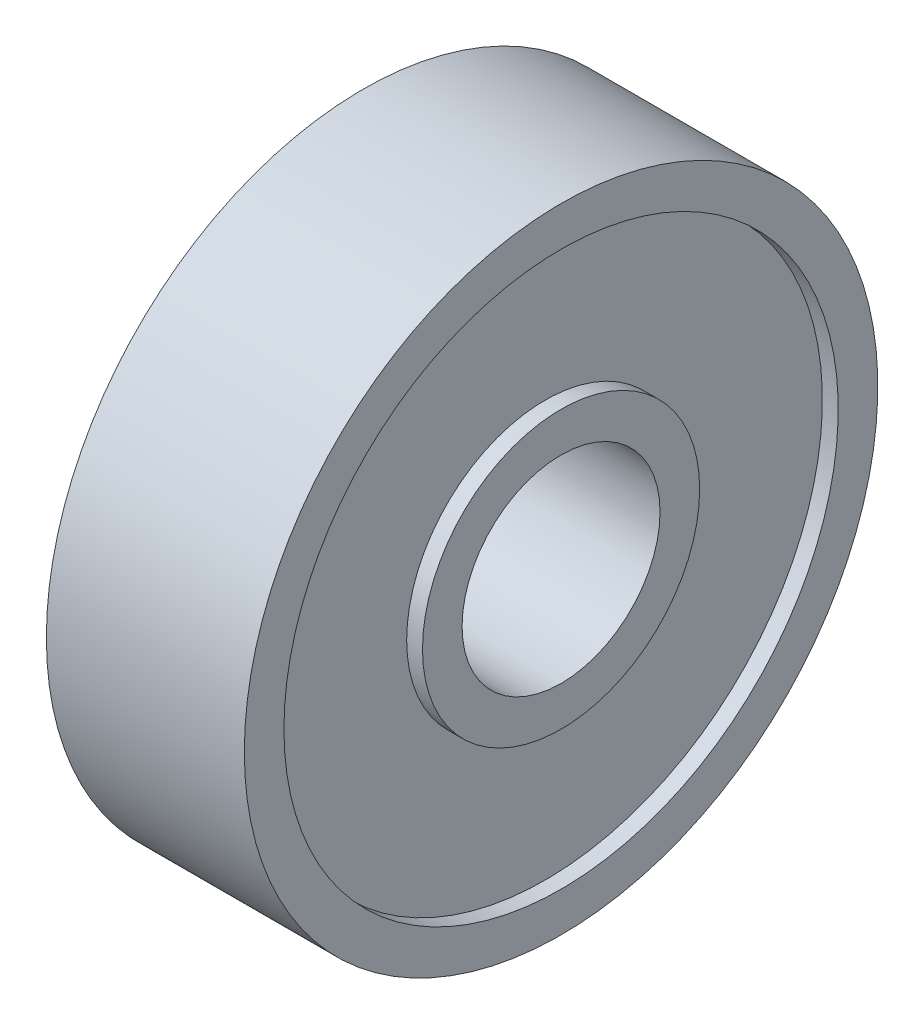
ISO-10303-21;
HEADER;
FILE_DESCRIPTION(('STEP AP214'),'2;1');
FILE_NAME('part.step','',(''),(''),'','','');
FILE_SCHEMA(('AUTOMOTIVE_DESIGN { 1 0 10303 214 1 1 1 1 }'));
ENDSEC;
DATA;
#1=APPLICATION_CONTEXT('core data for automotive mechanical design processes');
#2=APPLICATION_PROTOCOL_DEFINITION('international standard','automotive_design',2000,#1);
#3=PRODUCT_CONTEXT('',#1,'mechanical');
#4=PRODUCT('Part','Part','',(#3));
#5=PRODUCT_RELATED_PRODUCT_CATEGORY('part','',(#4));
#6=PRODUCT_DEFINITION_FORMATION('','',#4);
#7=PRODUCT_DEFINITION_CONTEXT('part definition',#1,'design');
#8=PRODUCT_DEFINITION('design','',#6,#7);
#9=PRODUCT_DEFINITION_SHAPE('','',#8);
#10=(LENGTH_UNIT() NAMED_UNIT(*) SI_UNIT(.MILLI.,.METRE.));
#11=(NAMED_UNIT(*) PLANE_ANGLE_UNIT() SI_UNIT($,.RADIAN.));
#12=(NAMED_UNIT(*) SI_UNIT($,.STERADIAN.) SOLID_ANGLE_UNIT());
#13=UNCERTAINTY_MEASURE_WITH_UNIT(LENGTH_MEASURE(1.E-05),#10,'distance_accuracy_value','');
#14=(GEOMETRIC_REPRESENTATION_CONTEXT(3) GLOBAL_UNCERTAINTY_ASSIGNED_CONTEXT((#13)) GLOBAL_UNIT_ASSIGNED_CONTEXT((#10,
#11,#12)) REPRESENTATION_CONTEXT('',''));
#15=CARTESIAN_POINT('',(0.,0.,0.));
#16=DIRECTION('',(0.,0.,1.));
#17=DIRECTION('',(1.,0.,0.));
#18=AXIS2_PLACEMENT_3D('',#15,#16,#17);
#19=CARTESIAN_POINT('',(-2.5,8.,0.));
#20=DIRECTION('',(1.,0.,0.));
#21=DIRECTION('',(0.,0.,-1.));
#22=AXIS2_PLACEMENT_3D('',#19,#20,#21);
#23=PLANE('',#22);
#24=CARTESIAN_POINT('',(-2.5,0.,0.));
#25=DIRECTION('',(-1.,0.,0.));
#26=DIRECTION('',(0.,0.,1.));
#27=AXIS2_PLACEMENT_3D('',#24,#25,#26);
#28=CIRCLE('',#27,7.);
#29=CARTESIAN_POINT('',(-2.5,0.,7.));
#30=VERTEX_POINT('',#29);
#31=EDGE_CURVE('E10',#30,#30,#28,.T.);
#32=ORIENTED_EDGE('',*,*,#31,.F.);
#33=EDGE_LOOP('',(#32));
#34=FACE_BOUND('',#33,.T.);
#35=CARTESIAN_POINT('',(-2.5,0.,0.));
#36=DIRECTION('',(-1.,0.,0.));
#37=DIRECTION('',(0.,0.,1.));
#38=AXIS2_PLACEMENT_3D('',#35,#36,#37);
#39=CIRCLE('',#38,8.);
#40=CARTESIAN_POINT('',(-2.5,0.,8.));
#41=VERTEX_POINT('',#40);
#42=EDGE_CURVE('E69',#41,#41,#39,.T.);
#43=ORIENTED_EDGE('',*,*,#42,.T.);
#44=EDGE_LOOP('',(#43));
#45=FACE_BOUND('',#44,.T.);
#46=ADVANCED_FACE('F29',(#34,#45),#23,.F.);
#47=CARTESIAN_POINT('',(-2.5,0.,0.));
#48=DIRECTION('',(-1.,0.,0.));
#49=DIRECTION('',(0.,0.,1.));
#50=AXIS2_PLACEMENT_3D('',#47,#48,#49);
#51=CYLINDRICAL_SURFACE('',#50,7.);
#52=CARTESIAN_POINT('',(-2.1,0.,0.));
#53=DIRECTION('',(-1.,0.,0.));
#54=DIRECTION('',(0.,0.,1.));
#55=AXIS2_PLACEMENT_3D('',#52,#53,#54);
#56=CIRCLE('',#55,7.);
#57=CARTESIAN_POINT('',(-2.1,0.,7.));
#58=VERTEX_POINT('',#57);
#59=EDGE_CURVE('E35',#58,#58,#56,.T.);
#60=ORIENTED_EDGE('',*,*,#59,.F.);
#61=EDGE_LOOP('',(#60));
#62=FACE_BOUND('',#61,.T.);
#63=ORIENTED_EDGE('',*,*,#31,.T.);
#64=EDGE_LOOP('',(#63));
#65=FACE_BOUND('',#64,.T.);
#66=ADVANCED_FACE('F130',(#62,#65),#51,.F.);
#67=CARTESIAN_POINT('',(-2.1,3.5,0.));
#68=DIRECTION('',(1.,0.,0.));
#69=DIRECTION('',(0.,0.,-1.));
#70=AXIS2_PLACEMENT_3D('',#67,#68,#69);
#71=PLANE('',#70);
#72=CARTESIAN_POINT('',(-2.1,0.,0.));
#73=DIRECTION('',(-1.,0.,0.));
#74=DIRECTION('',(0.,0.,1.));
#75=AXIS2_PLACEMENT_3D('',#72,#73,#74);
#76=CIRCLE('',#75,3.5);
#77=CARTESIAN_POINT('',(-2.1,0.,3.5));
#78=VERTEX_POINT('',#77);
#79=EDGE_CURVE('E39',#78,#78,#76,.T.);
#80=ORIENTED_EDGE('',*,*,#79,.F.);
#81=EDGE_LOOP('',(#80));
#82=FACE_BOUND('',#81,.T.);
#83=ORIENTED_EDGE('',*,*,#59,.T.);
#84=EDGE_LOOP('',(#83));
#85=FACE_BOUND('',#84,.T.);
#86=ADVANCED_FACE('F125',(#82,#85),#71,.F.);
#87=CARTESIAN_POINT('',(-2.5,0.,0.));
#88=DIRECTION('',(-1.,0.,0.));
#89=DIRECTION('',(0.,0.,1.));
#90=AXIS2_PLACEMENT_3D('',#87,#88,#89);
#91=CYLINDRICAL_SURFACE('',#90,3.5);
#92=CARTESIAN_POINT('',(-2.5,0.,0.));
#93=DIRECTION('',(-1.,0.,0.));
#94=DIRECTION('',(0.,0.,1.));
#95=AXIS2_PLACEMENT_3D('',#92,#93,#94);
#96=CIRCLE('',#95,3.5);
#97=CARTESIAN_POINT('',(-2.5,0.,3.5));
#98=VERTEX_POINT('',#97);
#99=EDGE_CURVE('E43',#98,#98,#96,.T.);
#100=ORIENTED_EDGE('',*,*,#99,.F.);
#101=EDGE_LOOP('',(#100));
#102=FACE_BOUND('',#101,.T.);
#103=ORIENTED_EDGE('',*,*,#79,.T.);
#104=EDGE_LOOP('',(#103));
#105=FACE_BOUND('',#104,.T.);
#106=ADVANCED_FACE('F119',(#102,#105),#91,.T.);
#107=CARTESIAN_POINT('',(-2.5,3.5,0.));
#108=DIRECTION('',(1.,0.,0.));
#109=DIRECTION('',(0.,0.,-1.));
#110=AXIS2_PLACEMENT_3D('',#107,#108,#109);
#111=PLANE('',#110);
#112=CARTESIAN_POINT('',(-2.5,0.,0.));
#113=DIRECTION('',(-1.,0.,0.));
#114=DIRECTION('',(0.,0.,1.));
#115=AXIS2_PLACEMENT_3D('',#112,#113,#114);
#116=CIRCLE('',#115,2.5);
#117=CARTESIAN_POINT('',(-2.5,0.,2.5));
#118=VERTEX_POINT('',#117);
#119=EDGE_CURVE('E48',#118,#118,#116,.T.);
#120=ORIENTED_EDGE('',*,*,#119,.F.);
#121=EDGE_LOOP('',(#120));
#122=FACE_BOUND('',#121,.T.);
#123=ORIENTED_EDGE('',*,*,#99,.T.);
#124=EDGE_LOOP('',(#123));
#125=FACE_BOUND('',#124,.T.);
#126=ADVANCED_FACE('F113',(#122,#125),#111,.F.);
#127=CARTESIAN_POINT('',(-2.5,0.,0.));
#128=DIRECTION('',(-1.,0.,0.));
#129=DIRECTION('',(0.,0.,1.));
#130=AXIS2_PLACEMENT_3D('',#127,#128,#129);
#131=CYLINDRICAL_SURFACE('',#130,2.5);
#132=CARTESIAN_POINT('',(2.5,0.,0.));
#133=DIRECTION('',(-1.,0.,0.));
#134=DIRECTION('',(0.,0.,1.));
#135=AXIS2_PLACEMENT_3D('',#132,#133,#134);
#136=CIRCLE('',#135,2.5);
#137=CARTESIAN_POINT('',(2.5,0.,2.5));
#138=VERTEX_POINT('',#137);
#139=EDGE_CURVE('E51',#138,#138,#136,.T.);
#140=ORIENTED_EDGE('',*,*,#139,.F.);
#141=EDGE_LOOP('',(#140));
#142=FACE_BOUND('',#141,.T.);
#143=ORIENTED_EDGE('',*,*,#119,.T.);
#144=EDGE_LOOP('',(#143));
#145=FACE_BOUND('',#144,.T.);
#146=ADVANCED_FACE('F107',(#142,#145),#131,.F.);
#147=CARTESIAN_POINT('',(2.5,3.5,0.));
#148=DIRECTION('',(-1.,0.,0.));
#149=DIRECTION('',(0.,0.,1.));
#150=AXIS2_PLACEMENT_3D('',#147,#148,#149);
#151=PLANE('',#150);
#152=CARTESIAN_POINT('',(2.5,0.,0.));
#153=DIRECTION('',(-1.,0.,0.));
#154=DIRECTION('',(0.,0.,1.));
#155=AXIS2_PLACEMENT_3D('',#152,#153,#154);
#156=CIRCLE('',#155,3.5);
#157=CARTESIAN_POINT('',(2.5,0.,3.5));
#158=VERTEX_POINT('',#157);
#159=EDGE_CURVE('E54',#158,#158,#156,.T.);
#160=ORIENTED_EDGE('',*,*,#159,.F.);
#161=EDGE_LOOP('',(#160));
#162=FACE_BOUND('',#161,.T.);
#163=ORIENTED_EDGE('',*,*,#139,.T.);
#164=EDGE_LOOP('',(#163));
#165=FACE_BOUND('',#164,.T.);
#166=ADVANCED_FACE('F101',(#162,#165),#151,.F.);
#167=CARTESIAN_POINT('',(-2.5,0.,0.));
#168=DIRECTION('',(-1.,0.,0.));
#169=DIRECTION('',(0.,0.,1.));
#170=AXIS2_PLACEMENT_3D('',#167,#168,#169);
#171=CYLINDRICAL_SURFACE('',#170,3.5);
#172=CARTESIAN_POINT('',(2.1,0.,0.));
#173=DIRECTION('',(-1.,0.,0.));
#174=DIRECTION('',(0.,0.,1.));
#175=AXIS2_PLACEMENT_3D('',#172,#173,#174);
#176=CIRCLE('',#175,3.5);
#177=CARTESIAN_POINT('',(2.1,0.,3.5));
#178=VERTEX_POINT('',#177);
#179=EDGE_CURVE('E57',#178,#178,#176,.T.);
#180=ORIENTED_EDGE('',*,*,#179,.F.);
#181=EDGE_LOOP('',(#180));
#182=FACE_BOUND('',#181,.T.);
#183=ORIENTED_EDGE('',*,*,#159,.T.);
#184=EDGE_LOOP('',(#183));
#185=FACE_BOUND('',#184,.T.);
#186=ADVANCED_FACE('F95',(#182,#185),#171,.T.);
#187=CARTESIAN_POINT('',(2.1,7.,0.));
#188=DIRECTION('',(-1.,0.,0.));
#189=DIRECTION('',(0.,0.,1.));
#190=AXIS2_PLACEMENT_3D('',#187,#188,#189);
#191=PLANE('',#190);
#192=CARTESIAN_POINT('',(2.1,0.,0.));
#193=DIRECTION('',(-1.,0.,0.));
#194=DIRECTION('',(0.,0.,1.));
#195=AXIS2_PLACEMENT_3D('',#192,#193,#194);
#196=CIRCLE('',#195,7.);
#197=CARTESIAN_POINT('',(2.1,0.,7.));
#198=VERTEX_POINT('',#197);
#199=EDGE_CURVE('E60',#198,#198,#196,.T.);
#200=ORIENTED_EDGE('',*,*,#199,.F.);
#201=EDGE_LOOP('',(#200));
#202=FACE_BOUND('',#201,.T.);
#203=ORIENTED_EDGE('',*,*,#179,.T.);
#204=EDGE_LOOP('',(#203));
#205=FACE_BOUND('',#204,.T.);
#206=ADVANCED_FACE('F89',(#202,#205),#191,.F.);
#207=CARTESIAN_POINT('',(-2.5,0.,0.));
#208=DIRECTION('',(-1.,0.,0.));
#209=DIRECTION('',(0.,0.,1.));
#210=AXIS2_PLACEMENT_3D('',#207,#208,#209);
#211=CYLINDRICAL_SURFACE('',#210,7.);
#212=CARTESIAN_POINT('',(2.5,0.,0.));
#213=DIRECTION('',(-1.,0.,0.));
#214=DIRECTION('',(0.,0.,1.));
#215=AXIS2_PLACEMENT_3D('',#212,#213,#214);
#216=CIRCLE('',#215,7.);
#217=CARTESIAN_POINT('',(2.5,0.,7.));
#218=VERTEX_POINT('',#217);
#219=EDGE_CURVE('E63',#218,#218,#216,.T.);
#220=ORIENTED_EDGE('',*,*,#219,.F.);
#221=EDGE_LOOP('',(#220));
#222=FACE_BOUND('',#221,.T.);
#223=ORIENTED_EDGE('',*,*,#199,.T.);
#224=EDGE_LOOP('',(#223));
#225=FACE_BOUND('',#224,.T.);
#226=ADVANCED_FACE('F83',(#222,#225),#211,.F.);
#227=CARTESIAN_POINT('',(2.5,8.,0.));
#228=DIRECTION('',(-1.,0.,0.));
#229=DIRECTION('',(0.,0.,1.));
#230=AXIS2_PLACEMENT_3D('',#227,#228,#229);
#231=PLANE('',#230);
#232=CARTESIAN_POINT('',(2.5,0.,0.));
#233=DIRECTION('',(-1.,0.,0.));
#234=DIRECTION('',(0.,0.,1.));
#235=AXIS2_PLACEMENT_3D('',#232,#233,#234);
#236=CIRCLE('',#235,8.);
#237=CARTESIAN_POINT('',(2.5,0.,8.));
#238=VERTEX_POINT('',#237);
#239=EDGE_CURVE('E66',#238,#238,#236,.T.);
#240=ORIENTED_EDGE('',*,*,#239,.F.);
#241=EDGE_LOOP('',(#240));
#242=FACE_BOUND('',#241,.T.);
#243=ORIENTED_EDGE('',*,*,#219,.T.);
#244=EDGE_LOOP('',(#243));
#245=FACE_BOUND('',#244,.T.);
#246=ADVANCED_FACE('F77',(#242,#245),#231,.F.);
#247=CARTESIAN_POINT('',(-2.5,0.,0.));
#248=DIRECTION('',(-1.,0.,0.));
#249=DIRECTION('',(0.,0.,1.));
#250=AXIS2_PLACEMENT_3D('',#247,#248,#249);
#251=CYLINDRICAL_SURFACE('',#250,8.);
#252=ORIENTED_EDGE('',*,*,#42,.F.);
#253=EDGE_LOOP('',(#252));
#254=FACE_BOUND('',#253,.T.);
#255=ORIENTED_EDGE('',*,*,#239,.T.);
#256=EDGE_LOOP('',(#255));
#257=FACE_BOUND('',#256,.T.);
#258=ADVANCED_FACE('F74',(#254,#257),#251,.T.);
#259=CLOSED_SHELL('',(#46,#66,#86,#106,#126,#146,#166,#186,#206,#226,#246,#258));
#260=MANIFOLD_SOLID_BREP('B2',#259);
#261=ADVANCED_BREP_SHAPE_REPRESENTATION('',(#18,#260),#14);
#262=SHAPE_DEFINITION_REPRESENTATION(#9,#261);
ENDSEC;
END-ISO-10303-21;
